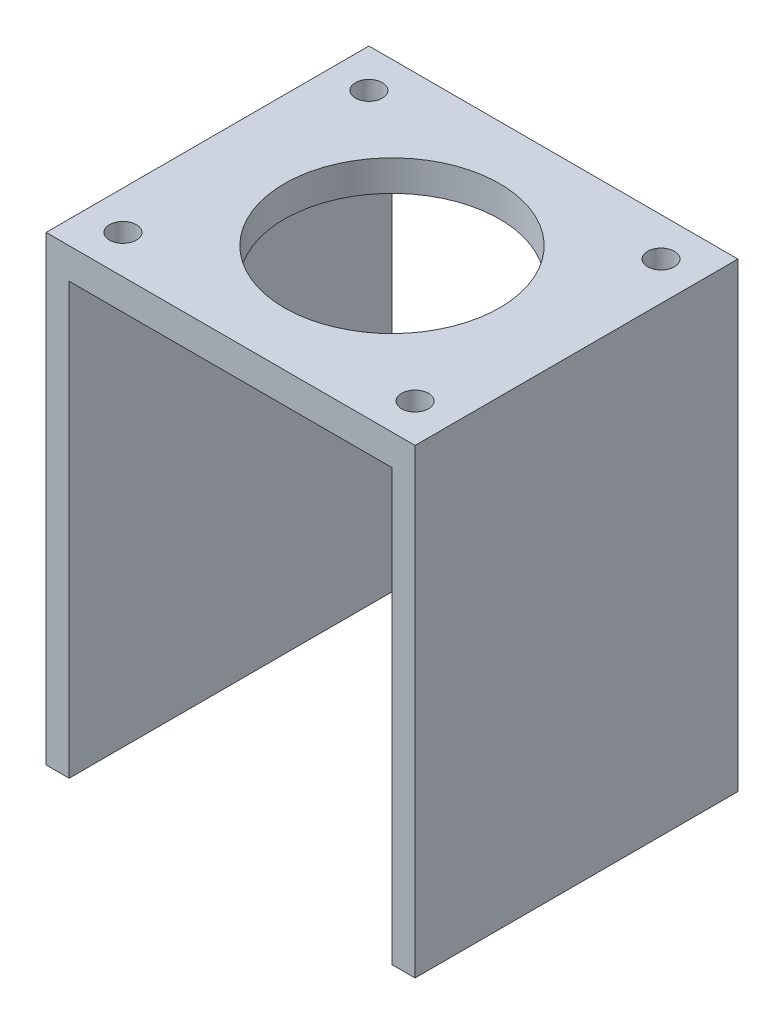
ISO-10303-21;
HEADER;
FILE_DESCRIPTION(('STEP AP214'),'2;1');
FILE_NAME('part.step','',(''),(''),'','','');
FILE_SCHEMA(('AUTOMOTIVE_DESIGN { 1 0 10303 214 1 1 1 1 }'));
ENDSEC;
DATA;
#1=APPLICATION_CONTEXT('core data for automotive mechanical design processes');
#2=APPLICATION_PROTOCOL_DEFINITION('international standard','automotive_design',2000,#1);
#3=PRODUCT_CONTEXT('',#1,'mechanical');
#4=PRODUCT('Part','Part','',(#3));
#5=PRODUCT_RELATED_PRODUCT_CATEGORY('part','',(#4));
#6=PRODUCT_DEFINITION_FORMATION('','',#4);
#7=PRODUCT_DEFINITION_CONTEXT('part definition',#1,'design');
#8=PRODUCT_DEFINITION('design','',#6,#7);
#9=PRODUCT_DEFINITION_SHAPE('','',#8);
#10=(LENGTH_UNIT() NAMED_UNIT(*) SI_UNIT(.MILLI.,.METRE.));
#11=(NAMED_UNIT(*) PLANE_ANGLE_UNIT() SI_UNIT($,.RADIAN.));
#12=(NAMED_UNIT(*) SI_UNIT($,.STERADIAN.) SOLID_ANGLE_UNIT());
#13=UNCERTAINTY_MEASURE_WITH_UNIT(LENGTH_MEASURE(1.E-05),#10,'distance_accuracy_value','');
#14=(GEOMETRIC_REPRESENTATION_CONTEXT(3) GLOBAL_UNCERTAINTY_ASSIGNED_CONTEXT((#13)) GLOBAL_UNIT_ASSIGNED_CONTEXT((#10,
#11,#12)) REPRESENTATION_CONTEXT('',''));
#15=CARTESIAN_POINT('',(0.,0.,0.));
#16=DIRECTION('',(0.,0.,1.));
#17=DIRECTION('',(1.,0.,0.));
#18=AXIS2_PLACEMENT_3D('',#15,#16,#17);
#19=CARTESIAN_POINT('',(24.,-30.,42.));
#20=DIRECTION('',(-1.,0.,0.));
#21=DIRECTION('',(0.,-1.,0.));
#22=AXIS2_PLACEMENT_3D('',#19,#20,#21);
#23=PLANE('',#22);
#24=DIRECTION('',(0.,1.,0.));
#25=VECTOR('',#24,1.);
#26=CARTESIAN_POINT('',(24.,-30.,0.));
#27=LINE('',#26,#25);
#28=CARTESIAN_POINT('',(24.,-30.,0.));
#29=VERTEX_POINT('',#28);
#30=CARTESIAN_POINT('',(24.,30.,0.));
#31=VERTEX_POINT('',#30);
#32=EDGE_CURVE('E135',#29,#31,#27,.T.);
#33=ORIENTED_EDGE('',*,*,#32,.T.);
#34=DIRECTION('',(0.,0.,-1.));
#35=VECTOR('',#34,1.);
#36=CARTESIAN_POINT('',(24.,30.,42.));
#37=LINE('',#36,#35);
#38=CARTESIAN_POINT('',(24.,30.,42.));
#39=VERTEX_POINT('',#38);
#40=EDGE_CURVE('E11',#39,#31,#37,.T.);
#41=ORIENTED_EDGE('',*,*,#40,.F.);
#42=DIRECTION('',(0.,1.,0.));
#43=VECTOR('',#42,1.);
#44=CARTESIAN_POINT('',(24.,-30.,42.));
#45=LINE('',#44,#43);
#46=CARTESIAN_POINT('',(24.,-30.,42.));
#47=VERTEX_POINT('',#46);
#48=EDGE_CURVE('E149',#47,#39,#45,.T.);
#49=ORIENTED_EDGE('',*,*,#48,.F.);
#50=DIRECTION('',(0.,0.,-1.));
#51=VECTOR('',#50,1.);
#52=CARTESIAN_POINT('',(24.,-30.,42.));
#53=LINE('',#52,#51);
#54=EDGE_CURVE('E131',#47,#29,#53,.T.);
#55=ORIENTED_EDGE('',*,*,#54,.T.);
#56=EDGE_LOOP('',(#33,#41,#49,#55));
#57=FACE_BOUND('',#56,.T.);
#58=ADVANCED_FACE('F37',(#57),#23,.F.);
#59=CARTESIAN_POINT('',(-24.,30.,42.));
#60=DIRECTION('',(0.,-1.,0.));
#61=DIRECTION('',(0.,0.,-1.));
#62=AXIS2_PLACEMENT_3D('',#59,#60,#61);
#63=PLANE('',#62);
#64=CARTESIAN_POINT('',(19.,30.,5.00000000000002));
#65=DIRECTION('',(0.,1.,0.));
#66=DIRECTION('',(0.,0.,-1.));
#67=AXIS2_PLACEMENT_3D('',#64,#65,#66);
#68=CIRCLE('',#67,1.75);
#69=CARTESIAN_POINT('',(19.,30.,3.25000000000002));
#70=VERTEX_POINT('',#69);
#71=EDGE_CURVE('E219',#70,#70,#68,.T.);
#72=ORIENTED_EDGE('',*,*,#71,.F.);
#73=EDGE_LOOP('',(#72));
#74=FACE_BOUND('',#73,.T.);
#75=CARTESIAN_POINT('',(-19.,30.,37.));
#76=DIRECTION('',(0.,1.,0.));
#77=DIRECTION('',(0.,0.,-1.));
#78=AXIS2_PLACEMENT_3D('',#75,#76,#77);
#79=CIRCLE('',#78,1.75);
#80=CARTESIAN_POINT('',(-19.,30.,35.25));
#81=VERTEX_POINT('',#80);
#82=EDGE_CURVE('E220',#81,#81,#79,.T.);
#83=ORIENTED_EDGE('',*,*,#82,.F.);
#84=EDGE_LOOP('',(#83));
#85=FACE_BOUND('',#84,.T.);
#86=CARTESIAN_POINT('',(-19.,30.,5.00000000000001));
#87=DIRECTION('',(0.,1.,0.));
#88=DIRECTION('',(0.,0.,1.));
#89=AXIS2_PLACEMENT_3D('',#86,#87,#88);
#90=CIRCLE('',#89,1.75);
#91=CARTESIAN_POINT('',(-19.,30.,6.75000000000001));
#92=VERTEX_POINT('',#91);
#93=EDGE_CURVE('E223',#92,#92,#90,.T.);
#94=ORIENTED_EDGE('',*,*,#93,.F.);
#95=EDGE_LOOP('',(#94));
#96=FACE_BOUND('',#95,.T.);
#97=CARTESIAN_POINT('',(0.,30.,21.));
#98=DIRECTION('',(0.,1.,0.));
#99=DIRECTION('',(0.,0.,1.));
#100=AXIS2_PLACEMENT_3D('',#97,#98,#99);
#101=CIRCLE('',#100,14.);
#102=CARTESIAN_POINT('',(0.,30.,35.));
#103=VERTEX_POINT('',#102);
#104=EDGE_CURVE('E225',#103,#103,#101,.T.);
#105=ORIENTED_EDGE('',*,*,#104,.F.);
#106=EDGE_LOOP('',(#105));
#107=FACE_BOUND('',#106,.T.);
#108=CARTESIAN_POINT('',(19.,30.,37.));
#109=DIRECTION('',(0.,1.,0.));
#110=DIRECTION('',(0.,0.,1.));
#111=AXIS2_PLACEMENT_3D('',#108,#109,#110);
#112=CIRCLE('',#111,1.75);
#113=CARTESIAN_POINT('',(19.,30.,38.75));
#114=VERTEX_POINT('',#113);
#115=EDGE_CURVE('E165',#114,#114,#112,.T.);
#116=ORIENTED_EDGE('',*,*,#115,.F.);
#117=EDGE_LOOP('',(#116));
#118=FACE_BOUND('',#117,.T.);
#119=DIRECTION('',(-1.,0.,0.));
#120=VECTOR('',#119,1.);
#121=CARTESIAN_POINT('',(-24.,30.,0.));
#122=LINE('',#121,#120);
#123=CARTESIAN_POINT('',(-24.,30.,0.));
#124=VERTEX_POINT('',#123);
#125=EDGE_CURVE('E138',#31,#124,#122,.T.);
#126=ORIENTED_EDGE('',*,*,#125,.T.);
#127=DIRECTION('',(0.,0.,-1.));
#128=VECTOR('',#127,1.);
#129=CARTESIAN_POINT('',(-24.,30.,42.));
#130=LINE('',#129,#128);
#131=CARTESIAN_POINT('',(-24.,30.,42.));
#132=VERTEX_POINT('',#131);
#133=EDGE_CURVE('E46',#132,#124,#130,.T.);
#134=ORIENTED_EDGE('',*,*,#133,.F.);
#135=DIRECTION('',(-1.,0.,0.));
#136=VECTOR('',#135,1.);
#137=CARTESIAN_POINT('',(-24.,30.,42.));
#138=LINE('',#137,#136);
#139=EDGE_CURVE('E98',#39,#132,#138,.T.);
#140=ORIENTED_EDGE('',*,*,#139,.F.);
#141=ORIENTED_EDGE('',*,*,#40,.T.);
#142=EDGE_LOOP('',(#126,#134,#140,#141));
#143=FACE_BOUND('',#142,.T.);
#144=ADVANCED_FACE('F192',(#74,#85,#96,#107,#118,#143),#63,.F.);
#145=CARTESIAN_POINT('',(-24.,-30.,42.));
#146=DIRECTION('',(1.,0.,0.));
#147=DIRECTION('',(0.,0.,-1.));
#148=AXIS2_PLACEMENT_3D('',#145,#146,#147);
#149=PLANE('',#148);
#150=DIRECTION('',(0.,-1.,0.));
#151=VECTOR('',#150,1.);
#152=CARTESIAN_POINT('',(-24.,-30.,0.));
#153=LINE('',#152,#151);
#154=CARTESIAN_POINT('',(-24.,-30.,0.));
#155=VERTEX_POINT('',#154);
#156=EDGE_CURVE('E140',#124,#155,#153,.T.);
#157=ORIENTED_EDGE('',*,*,#156,.T.);
#158=DIRECTION('',(0.,0.,-1.));
#159=VECTOR('',#158,1.);
#160=CARTESIAN_POINT('',(-24.,-30.,42.));
#161=LINE('',#160,#159);
#162=CARTESIAN_POINT('',(-24.,-30.,42.));
#163=VERTEX_POINT('',#162);
#164=EDGE_CURVE('E156',#163,#155,#161,.T.);
#165=ORIENTED_EDGE('',*,*,#164,.F.);
#166=DIRECTION('',(0.,-1.,0.));
#167=VECTOR('',#166,1.);
#168=CARTESIAN_POINT('',(-24.,-30.,42.));
#169=LINE('',#168,#167);
#170=EDGE_CURVE('E209',#132,#163,#169,.T.);
#171=ORIENTED_EDGE('',*,*,#170,.F.);
#172=ORIENTED_EDGE('',*,*,#133,.T.);
#173=EDGE_LOOP('',(#157,#165,#171,#172));
#174=FACE_BOUND('',#173,.T.);
#175=ADVANCED_FACE('F197',(#174),#149,.F.);
#176=CARTESIAN_POINT('',(-24.,-30.,42.));
#177=DIRECTION('',(0.,1.,0.));
#178=DIRECTION('',(0.,0.,1.));
#179=AXIS2_PLACEMENT_3D('',#176,#177,#178);
#180=PLANE('',#179);
#181=DIRECTION('',(1.,0.,0.));
#182=VECTOR('',#181,1.);
#183=CARTESIAN_POINT('',(-24.,-30.,0.));
#184=LINE('',#183,#182);
#185=CARTESIAN_POINT('',(-21.,-30.,0.));
#186=VERTEX_POINT('',#185);
#187=EDGE_CURVE('E142',#155,#186,#184,.T.);
#188=ORIENTED_EDGE('',*,*,#187,.T.);
#189=DIRECTION('',(0.,0.,-1.));
#190=VECTOR('',#189,1.);
#191=CARTESIAN_POINT('',(-21.,-30.,42.));
#192=LINE('',#191,#190);
#193=CARTESIAN_POINT('',(-21.,-30.,42.));
#194=VERTEX_POINT('',#193);
#195=EDGE_CURVE('E153',#194,#186,#192,.T.);
#196=ORIENTED_EDGE('',*,*,#195,.F.);
#197=DIRECTION('',(1.,0.,0.));
#198=VECTOR('',#197,1.);
#199=CARTESIAN_POINT('',(-24.,-30.,42.));
#200=LINE('',#199,#198);
#201=EDGE_CURVE('E211',#163,#194,#200,.T.);
#202=ORIENTED_EDGE('',*,*,#201,.F.);
#203=ORIENTED_EDGE('',*,*,#164,.T.);
#204=EDGE_LOOP('',(#188,#196,#202,#203));
#205=FACE_BOUND('',#204,.T.);
#206=ADVANCED_FACE('F254',(#205),#180,.F.);
#207=CARTESIAN_POINT('',(-21.,-30.,42.));
#208=DIRECTION('',(-1.,0.,0.));
#209=DIRECTION('',(0.,-1.,0.));
#210=AXIS2_PLACEMENT_3D('',#207,#208,#209);
#211=PLANE('',#210);
#212=DIRECTION('',(0.,1.,0.));
#213=VECTOR('',#212,1.);
#214=CARTESIAN_POINT('',(-21.,-30.,0.));
#215=LINE('',#214,#213);
#216=CARTESIAN_POINT('',(-21.,26.,0.));
#217=VERTEX_POINT('',#216);
#218=EDGE_CURVE('E144',#186,#217,#215,.T.);
#219=ORIENTED_EDGE('',*,*,#218,.T.);
#220=DIRECTION('',(0.,0.,-1.));
#221=VECTOR('',#220,1.);
#222=CARTESIAN_POINT('',(-21.,26.,42.));
#223=LINE('',#222,#221);
#224=CARTESIAN_POINT('',(-21.,26.,42.));
#225=VERTEX_POINT('',#224);
#226=EDGE_CURVE('E126',#225,#217,#223,.T.);
#227=ORIENTED_EDGE('',*,*,#226,.F.);
#228=DIRECTION('',(0.,1.,0.));
#229=VECTOR('',#228,1.);
#230=CARTESIAN_POINT('',(-21.,-30.,42.));
#231=LINE('',#230,#229);
#232=EDGE_CURVE('E117',#194,#225,#231,.T.);
#233=ORIENTED_EDGE('',*,*,#232,.F.);
#234=ORIENTED_EDGE('',*,*,#195,.T.);
#235=EDGE_LOOP('',(#219,#227,#233,#234));
#236=FACE_BOUND('',#235,.T.);
#237=ADVANCED_FACE('F246',(#236),#211,.F.);
#238=CARTESIAN_POINT('',(-21.,26.,42.));
#239=DIRECTION('',(0.,1.,0.));
#240=DIRECTION('',(0.,0.,1.));
#241=AXIS2_PLACEMENT_3D('',#238,#239,#240);
#242=PLANE('',#241);
#243=CARTESIAN_POINT('',(19.,26.,5.00000000000002));
#244=DIRECTION('',(0.,1.,0.));
#245=DIRECTION('',(0.,0.,1.));
#246=AXIS2_PLACEMENT_3D('',#243,#244,#245);
#247=CIRCLE('',#246,1.75);
#248=CARTESIAN_POINT('',(19.,26.,6.75000000000002));
#249=VERTEX_POINT('',#248);
#250=EDGE_CURVE('E40',#249,#249,#247,.T.);
#251=ORIENTED_EDGE('',*,*,#250,.T.);
#252=EDGE_LOOP('',(#251));
#253=FACE_BOUND('',#252,.T.);
#254=CARTESIAN_POINT('',(-19.,26.,37.));
#255=DIRECTION('',(0.,1.,0.));
#256=DIRECTION('',(0.,0.,1.));
#257=AXIS2_PLACEMENT_3D('',#254,#255,#256);
#258=CIRCLE('',#257,1.75);
#259=CARTESIAN_POINT('',(-19.,26.,38.75));
#260=VERTEX_POINT('',#259);
#261=EDGE_CURVE('E170',#260,#260,#258,.T.);
#262=ORIENTED_EDGE('',*,*,#261,.T.);
#263=EDGE_LOOP('',(#262));
#264=FACE_BOUND('',#263,.T.);
#265=CARTESIAN_POINT('',(-19.,26.,5.00000000000001));
#266=DIRECTION('',(0.,1.,0.));
#267=DIRECTION('',(0.,0.,1.));
#268=AXIS2_PLACEMENT_3D('',#265,#266,#267);
#269=CIRCLE('',#268,1.75);
#270=CARTESIAN_POINT('',(-19.,26.,6.75000000000001));
#271=VERTEX_POINT('',#270);
#272=EDGE_CURVE('E168',#271,#271,#269,.T.);
#273=ORIENTED_EDGE('',*,*,#272,.T.);
#274=EDGE_LOOP('',(#273));
#275=FACE_BOUND('',#274,.T.);
#276=CARTESIAN_POINT('',(0.,26.,21.));
#277=DIRECTION('',(0.,1.,0.));
#278=DIRECTION('',(0.,0.,1.));
#279=AXIS2_PLACEMENT_3D('',#276,#277,#278);
#280=CIRCLE('',#279,14.);
#281=CARTESIAN_POINT('',(0.,26.,35.));
#282=VERTEX_POINT('',#281);
#283=EDGE_CURVE('E164',#282,#282,#280,.T.);
#284=ORIENTED_EDGE('',*,*,#283,.T.);
#285=EDGE_LOOP('',(#284));
#286=FACE_BOUND('',#285,.T.);
#287=CARTESIAN_POINT('',(19.,26.,37.));
#288=DIRECTION('',(0.,1.,0.));
#289=DIRECTION('',(0.,0.,1.));
#290=AXIS2_PLACEMENT_3D('',#287,#288,#289);
#291=CIRCLE('',#290,1.75);
#292=CARTESIAN_POINT('',(19.,26.,38.75));
#293=VERTEX_POINT('',#292);
#294=EDGE_CURVE('E161',#293,#293,#291,.T.);
#295=ORIENTED_EDGE('',*,*,#294,.T.);
#296=EDGE_LOOP('',(#295));
#297=FACE_BOUND('',#296,.T.);
#298=DIRECTION('',(1.,0.,0.));
#299=VECTOR('',#298,1.);
#300=CARTESIAN_POINT('',(-21.,26.,0.));
#301=LINE('',#300,#299);
#302=CARTESIAN_POINT('',(21.,26.,0.));
#303=VERTEX_POINT('',#302);
#304=EDGE_CURVE('E125',#217,#303,#301,.T.);
#305=ORIENTED_EDGE('',*,*,#304,.T.);
#306=DIRECTION('',(0.,0.,-1.));
#307=VECTOR('',#306,1.);
#308=CARTESIAN_POINT('',(21.,26.,42.));
#309=LINE('',#308,#307);
#310=CARTESIAN_POINT('',(21.,26.,42.));
#311=VERTEX_POINT('',#310);
#312=EDGE_CURVE('E122',#311,#303,#309,.T.);
#313=ORIENTED_EDGE('',*,*,#312,.F.);
#314=DIRECTION('',(1.,0.,0.));
#315=VECTOR('',#314,1.);
#316=CARTESIAN_POINT('',(-21.,26.,42.));
#317=LINE('',#316,#315);
#318=EDGE_CURVE('E111',#225,#311,#317,.T.);
#319=ORIENTED_EDGE('',*,*,#318,.F.);
#320=ORIENTED_EDGE('',*,*,#226,.T.);
#321=EDGE_LOOP('',(#305,#313,#319,#320));
#322=FACE_BOUND('',#321,.T.);
#323=ADVANCED_FACE('F123',(#253,#264,#275,#286,#297,#322),#242,.F.);
#324=CARTESIAN_POINT('',(21.,26.,42.));
#325=DIRECTION('',(1.,0.,0.));
#326=DIRECTION('',(0.,1.,0.));
#327=AXIS2_PLACEMENT_3D('',#324,#325,#326);
#328=PLANE('',#327);
#329=DIRECTION('',(0.,-1.,0.));
#330=VECTOR('',#329,1.);
#331=CARTESIAN_POINT('',(21.,26.,0.));
#332=LINE('',#331,#330);
#333=CARTESIAN_POINT('',(21.,-30.,0.));
#334=VERTEX_POINT('',#333);
#335=EDGE_CURVE('E84',#303,#334,#332,.T.);
#336=ORIENTED_EDGE('',*,*,#335,.T.);
#337=DIRECTION('',(0.,0.,-1.));
#338=VECTOR('',#337,1.);
#339=CARTESIAN_POINT('',(21.,-30.,42.));
#340=LINE('',#339,#338);
#341=CARTESIAN_POINT('',(21.,-30.,42.));
#342=VERTEX_POINT('',#341);
#343=EDGE_CURVE('E127',#342,#334,#340,.T.);
#344=ORIENTED_EDGE('',*,*,#343,.F.);
#345=DIRECTION('',(0.,-1.,0.));
#346=VECTOR('',#345,1.);
#347=CARTESIAN_POINT('',(21.,26.,42.));
#348=LINE('',#347,#346);
#349=EDGE_CURVE('E115',#311,#342,#348,.T.);
#350=ORIENTED_EDGE('',*,*,#349,.F.);
#351=ORIENTED_EDGE('',*,*,#312,.T.);
#352=EDGE_LOOP('',(#336,#344,#350,#351));
#353=FACE_BOUND('',#352,.T.);
#354=ADVANCED_FACE('F129',(#353),#328,.F.);
#355=CARTESIAN_POINT('',(21.,-30.,42.));
#356=DIRECTION('',(0.,1.,0.));
#357=DIRECTION('',(0.,0.,1.));
#358=AXIS2_PLACEMENT_3D('',#355,#356,#357);
#359=PLANE('',#358);
#360=DIRECTION('',(1.,0.,0.));
#361=VECTOR('',#360,1.);
#362=CARTESIAN_POINT('',(21.,-30.,0.));
#363=LINE('',#362,#361);
#364=EDGE_CURVE('E90',#334,#29,#363,.T.);
#365=ORIENTED_EDGE('',*,*,#364,.T.);
#366=ORIENTED_EDGE('',*,*,#54,.F.);
#367=DIRECTION('',(1.,0.,0.));
#368=VECTOR('',#367,1.);
#369=CARTESIAN_POINT('',(21.,-30.,42.));
#370=LINE('',#369,#368);
#371=EDGE_CURVE('E55',#342,#47,#370,.T.);
#372=ORIENTED_EDGE('',*,*,#371,.F.);
#373=ORIENTED_EDGE('',*,*,#343,.T.);
#374=EDGE_LOOP('',(#365,#366,#372,#373));
#375=FACE_BOUND('',#374,.T.);
#376=ADVANCED_FACE('F252',(#375),#359,.F.);
#377=CARTESIAN_POINT('',(0.,0.,42.));
#378=DIRECTION('',(0.,0.,-1.));
#379=DIRECTION('',(-1.,0.,0.));
#380=AXIS2_PLACEMENT_3D('',#377,#378,#379);
#381=PLANE('',#380);
#382=ORIENTED_EDGE('',*,*,#48,.T.);
#383=ORIENTED_EDGE('',*,*,#139,.T.);
#384=ORIENTED_EDGE('',*,*,#170,.T.);
#385=ORIENTED_EDGE('',*,*,#201,.T.);
#386=ORIENTED_EDGE('',*,*,#232,.T.);
#387=ORIENTED_EDGE('',*,*,#318,.T.);
#388=ORIENTED_EDGE('',*,*,#349,.T.);
#389=ORIENTED_EDGE('',*,*,#371,.T.);
#390=EDGE_LOOP('',(#382,#383,#384,#385,#386,#387,#388,#389));
#391=FACE_BOUND('',#390,.T.);
#392=ADVANCED_FACE('F113',(#391),#381,.F.);
#393=CARTESIAN_POINT('',(0.,0.,0.));
#394=DIRECTION('',(0.,0.,-1.));
#395=DIRECTION('',(-1.,0.,0.));
#396=AXIS2_PLACEMENT_3D('',#393,#394,#395);
#397=PLANE('',#396);
#398=ORIENTED_EDGE('',*,*,#32,.F.);
#399=ORIENTED_EDGE('',*,*,#364,.F.);
#400=ORIENTED_EDGE('',*,*,#335,.F.);
#401=ORIENTED_EDGE('',*,*,#304,.F.);
#402=ORIENTED_EDGE('',*,*,#218,.F.);
#403=ORIENTED_EDGE('',*,*,#187,.F.);
#404=ORIENTED_EDGE('',*,*,#156,.F.);
#405=ORIENTED_EDGE('',*,*,#125,.F.);
#406=EDGE_LOOP('',(#398,#399,#400,#401,#402,#403,#404,#405));
#407=FACE_BOUND('',#406,.T.);
#408=ADVANCED_FACE('F203',(#407),#397,.T.);
#409=CARTESIAN_POINT('',(19.,-30.,37.));
#410=DIRECTION('',(0.,1.,0.));
#411=DIRECTION('',(0.,0.,1.));
#412=AXIS2_PLACEMENT_3D('',#409,#410,#411);
#413=CYLINDRICAL_SURFACE('',#412,1.75);
#414=ORIENTED_EDGE('',*,*,#115,.T.);
#415=EDGE_LOOP('',(#414));
#416=FACE_BOUND('',#415,.T.);
#417=ORIENTED_EDGE('',*,*,#294,.F.);
#418=EDGE_LOOP('',(#417));
#419=FACE_BOUND('',#418,.T.);
#420=ADVANCED_FACE('F238',(#416,#419),#413,.F.);
#421=CARTESIAN_POINT('',(0.,-30.,21.));
#422=DIRECTION('',(0.,1.,0.));
#423=DIRECTION('',(0.,0.,1.));
#424=AXIS2_PLACEMENT_3D('',#421,#422,#423);
#425=CYLINDRICAL_SURFACE('',#424,14.);
#426=ORIENTED_EDGE('',*,*,#104,.T.);
#427=EDGE_LOOP('',(#426));
#428=FACE_BOUND('',#427,.T.);
#429=ORIENTED_EDGE('',*,*,#283,.F.);
#430=EDGE_LOOP('',(#429));
#431=FACE_BOUND('',#430,.T.);
#432=ADVANCED_FACE('F241',(#428,#431),#425,.F.);
#433=CARTESIAN_POINT('',(-19.,-30.,5.00000000000001));
#434=DIRECTION('',(0.,1.,0.));
#435=DIRECTION('',(0.,0.,1.));
#436=AXIS2_PLACEMENT_3D('',#433,#434,#435);
#437=CYLINDRICAL_SURFACE('',#436,1.75);
#438=ORIENTED_EDGE('',*,*,#93,.T.);
#439=EDGE_LOOP('',(#438));
#440=FACE_BOUND('',#439,.T.);
#441=ORIENTED_EDGE('',*,*,#272,.F.);
#442=EDGE_LOOP('',(#441));
#443=FACE_BOUND('',#442,.T.);
#444=ADVANCED_FACE('F186',(#440,#443),#437,.F.);
#445=CARTESIAN_POINT('',(-19.,-30.,37.));
#446=DIRECTION('',(0.,1.,0.));
#447=DIRECTION('',(0.,0.,1.));
#448=AXIS2_PLACEMENT_3D('',#445,#446,#447);
#449=CYLINDRICAL_SURFACE('',#448,1.75);
#450=ORIENTED_EDGE('',*,*,#82,.T.);
#451=EDGE_LOOP('',(#450));
#452=FACE_BOUND('',#451,.T.);
#453=ORIENTED_EDGE('',*,*,#261,.F.);
#454=EDGE_LOOP('',(#453));
#455=FACE_BOUND('',#454,.T.);
#456=ADVANCED_FACE('F180',(#452,#455),#449,.F.);
#457=CARTESIAN_POINT('',(19.,-30.,5.00000000000002));
#458=DIRECTION('',(0.,1.,0.));
#459=DIRECTION('',(0.,0.,1.));
#460=AXIS2_PLACEMENT_3D('',#457,#458,#459);
#461=CYLINDRICAL_SURFACE('',#460,1.75);
#462=ORIENTED_EDGE('',*,*,#71,.T.);
#463=EDGE_LOOP('',(#462));
#464=FACE_BOUND('',#463,.T.);
#465=ORIENTED_EDGE('',*,*,#250,.F.);
#466=EDGE_LOOP('',(#465));
#467=FACE_BOUND('',#466,.T.);
#468=ADVANCED_FACE('F178',(#464,#467),#461,.F.);
#469=CLOSED_SHELL('',(#58,#144,#175,#206,#237,#323,#354,#376,#392,#408,#420,#432,#444,#456,#468));
#470=MANIFOLD_SOLID_BREP('B2',#469);
#471=ADVANCED_BREP_SHAPE_REPRESENTATION('',(#18,#470),#14);
#472=SHAPE_DEFINITION_REPRESENTATION(#9,#471);
ENDSEC;
END-ISO-10303-21;
